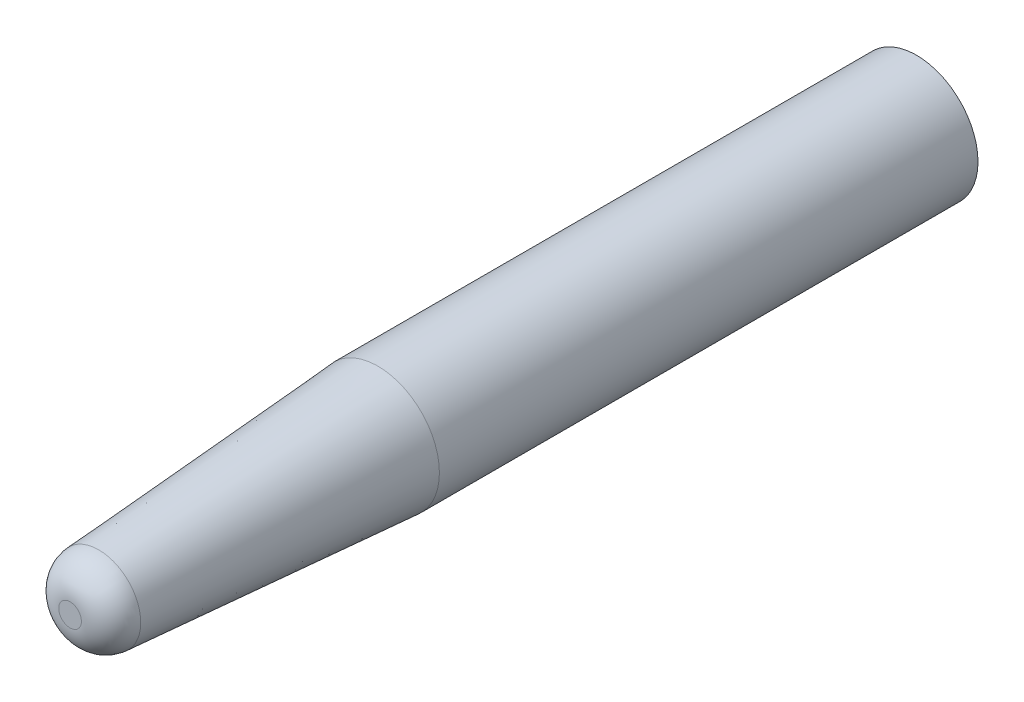
ISO-10303-21;
HEADER;
FILE_DESCRIPTION(('STEP AP214'),'2;1');
FILE_NAME('part.step','',(''),(''),'','','');
FILE_SCHEMA(('AUTOMOTIVE_DESIGN { 1 0 10303 214 1 1 1 1 }'));
ENDSEC;
DATA;
#1=APPLICATION_CONTEXT('core data for automotive mechanical design processes');
#2=APPLICATION_PROTOCOL_DEFINITION('international standard','automotive_design',2000,#1);
#3=PRODUCT_CONTEXT('',#1,'mechanical');
#4=PRODUCT('Part','Part','',(#3));
#5=PRODUCT_RELATED_PRODUCT_CATEGORY('part','',(#4));
#6=PRODUCT_DEFINITION_FORMATION('','',#4);
#7=PRODUCT_DEFINITION_CONTEXT('part definition',#1,'design');
#8=PRODUCT_DEFINITION('design','',#6,#7);
#9=PRODUCT_DEFINITION_SHAPE('','',#8);
#10=(LENGTH_UNIT() NAMED_UNIT(*) SI_UNIT(.MILLI.,.METRE.));
#11=(NAMED_UNIT(*) PLANE_ANGLE_UNIT() SI_UNIT($,.RADIAN.));
#12=(NAMED_UNIT(*) SI_UNIT($,.STERADIAN.) SOLID_ANGLE_UNIT());
#13=UNCERTAINTY_MEASURE_WITH_UNIT(LENGTH_MEASURE(1.E-05),#10,'distance_accuracy_value','');
#14=(GEOMETRIC_REPRESENTATION_CONTEXT(3) GLOBAL_UNCERTAINTY_ASSIGNED_CONTEXT((#13)) GLOBAL_UNIT_ASSIGNED_CONTEXT((#10,
#11,#12)) REPRESENTATION_CONTEXT('',''));
#15=CARTESIAN_POINT('',(0.,0.,0.));
#16=DIRECTION('',(0.,0.,1.));
#17=DIRECTION('',(1.,0.,0.));
#18=AXIS2_PLACEMENT_3D('',#15,#16,#17);
#19=CARTESIAN_POINT('',(0.,0.,0.));
#20=DIRECTION('',(0.,0.,-1.));
#21=DIRECTION('',(1.,0.,0.));
#22=AXIS2_PLACEMENT_3D('',#19,#20,#21);
#23=CONICAL_SURFACE('',#22,2.,0.0698131700797732);
#24=CARTESIAN_POINT('',(0.,0.,9.06975647374413));
#25=DIRECTION('',(0.,0.,-1.));
#26=DIRECTION('',(-1.,0.,0.));
#27=AXIS2_PLACEMENT_3D('',#24,#25,#26);
#28=CIRCLE('',#27,1.36578084468706);
#29=CARTESIAN_POINT('',(-1.36578084468706,0.,9.06975647374413));
#30=VERTEX_POINT('',#29);
#31=EDGE_CURVE('E10',#30,#30,#28,.T.);
#32=ORIENTED_EDGE('',*,*,#31,.T.);
#33=EDGE_LOOP('',(#32));
#34=FACE_BOUND('',#33,.T.);
#35=CARTESIAN_POINT('',(0.,0.,0.));
#36=DIRECTION('',(0.,0.,1.));
#37=DIRECTION('',(1.,0.,0.));
#38=AXIS2_PLACEMENT_3D('',#35,#36,#37);
#39=CIRCLE('',#38,2.);
#40=CARTESIAN_POINT('',(2.,0.,0.));
#41=VERTEX_POINT('',#40);
#42=EDGE_CURVE('E46',#41,#41,#39,.T.);
#43=ORIENTED_EDGE('',*,*,#42,.T.);
#44=EDGE_LOOP('',(#43));
#45=FACE_BOUND('',#44,.T.);
#46=ADVANCED_FACE('F31',(#34,#45),#23,.T.);
#47=CARTESIAN_POINT('',(0.,0.,10.));
#48=DIRECTION('',(0.,0.,1.));
#49=DIRECTION('',(1.,0.,0.));
#50=AXIS2_PLACEMENT_3D('',#47,#48,#49);
#51=PLANE('',#50);
#52=CARTESIAN_POINT('',(0.,0.,10.));
#53=DIRECTION('',(0.,0.,1.));
#54=DIRECTION('',(1.,0.,0.));
#55=AXIS2_PLACEMENT_3D('',#52,#53,#54);
#56=CIRCLE('',#55,0.368216794427234);
#57=CARTESIAN_POINT('',(0.368216794427234,0.,10.));
#58=VERTEX_POINT('',#57);
#59=EDGE_CURVE('E38',#58,#58,#56,.T.);
#60=ORIENTED_EDGE('',*,*,#59,.T.);
#61=EDGE_LOOP('',(#60));
#62=FACE_BOUND('',#61,.T.);
#63=ADVANCED_FACE('F56',(#62),#51,.T.);
#64=CARTESIAN_POINT('',(0.,0.,-17.5));
#65=DIRECTION('',(0.,0.,1.));
#66=DIRECTION('',(1.,0.,0.));
#67=AXIS2_PLACEMENT_3D('',#64,#65,#66);
#68=CYLINDRICAL_SURFACE('',#67,2.);
#69=CARTESIAN_POINT('',(0.,0.,-17.5));
#70=DIRECTION('',(0.,0.,1.));
#71=DIRECTION('',(1.,0.,0.));
#72=AXIS2_PLACEMENT_3D('',#69,#70,#71);
#73=CIRCLE('',#72,2.);
#74=CARTESIAN_POINT('',(2.,0.,-17.5));
#75=VERTEX_POINT('',#74);
#76=EDGE_CURVE('E42',#75,#75,#73,.T.);
#77=ORIENTED_EDGE('',*,*,#76,.T.);
#78=EDGE_LOOP('',(#77));
#79=FACE_BOUND('',#78,.T.);
#80=ORIENTED_EDGE('',*,*,#42,.F.);
#81=EDGE_LOOP('',(#80));
#82=FACE_BOUND('',#81,.T.);
#83=ADVANCED_FACE('F53',(#79,#82),#68,.T.);
#84=CARTESIAN_POINT('',(0.,0.,-17.5));
#85=DIRECTION('',(0.,0.,1.));
#86=DIRECTION('',(1.,0.,0.));
#87=AXIS2_PLACEMENT_3D('',#84,#85,#86);
#88=PLANE('',#87);
#89=ORIENTED_EDGE('',*,*,#76,.F.);
#90=EDGE_LOOP('',(#89));
#91=FACE_BOUND('',#90,.T.);
#92=ADVANCED_FACE('F55',(#91),#88,.F.);
#93=CARTESIAN_POINT('',(0.,0.,9.));
#94=DIRECTION('',(0.,0.,1.));
#95=DIRECTION('',(1.,0.,0.));
#96=AXIS2_PLACEMENT_3D('',#93,#94,#95);
#97=DEGENERATE_TOROIDAL_SURFACE('',#96,0.368216794427234,1.,.T.);
#98=ORIENTED_EDGE('',*,*,#31,.F.);
#99=EDGE_LOOP('',(#98));
#100=FACE_BOUND('',#99,.T.);
#101=ORIENTED_EDGE('',*,*,#59,.F.);
#102=EDGE_LOOP('',(#101));
#103=FACE_BOUND('',#102,.T.);
#104=ADVANCED_FACE('F33',(#100,#103),#97,.T.);
#105=CLOSED_SHELL('',(#46,#63,#83,#92,#104));
#106=MANIFOLD_SOLID_BREP('B2',#105);
#107=ADVANCED_BREP_SHAPE_REPRESENTATION('',(#18,#106),#14);
#108=SHAPE_DEFINITION_REPRESENTATION(#9,#107);
ENDSEC;
END-ISO-10303-21;
